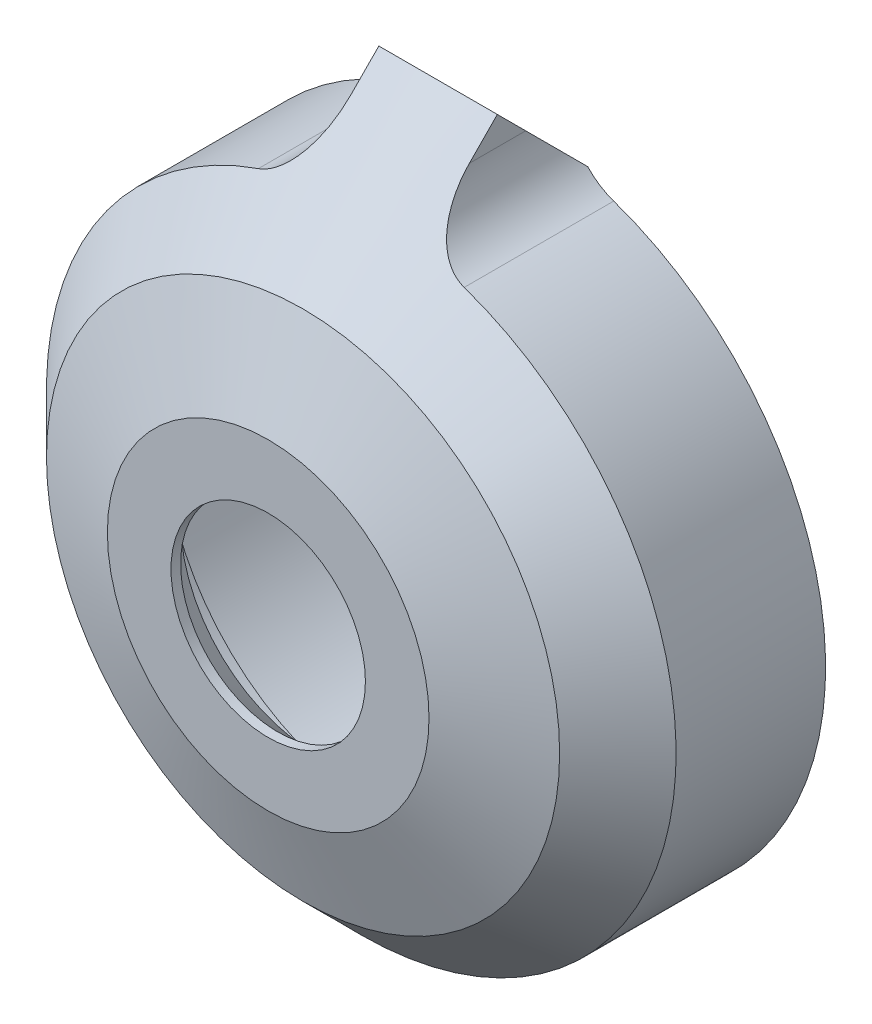
ISO-10303-21;
HEADER;
FILE_DESCRIPTION(('STEP AP214'),'2;1');
FILE_NAME('part.step','',(''),(''),'','','');
FILE_SCHEMA(('AUTOMOTIVE_DESIGN { 1 0 10303 214 1 1 1 1 }'));
ENDSEC;
DATA;
#1=APPLICATION_CONTEXT('core data for automotive mechanical design processes');
#2=APPLICATION_PROTOCOL_DEFINITION('international standard','automotive_design',2000,#1);
#3=PRODUCT_CONTEXT('',#1,'mechanical');
#4=PRODUCT('Part','Part','',(#3));
#5=PRODUCT_RELATED_PRODUCT_CATEGORY('part','',(#4));
#6=PRODUCT_DEFINITION_FORMATION('','',#4);
#7=PRODUCT_DEFINITION_CONTEXT('part definition',#1,'design');
#8=PRODUCT_DEFINITION('design','',#6,#7);
#9=PRODUCT_DEFINITION_SHAPE('','',#8);
#10=(LENGTH_UNIT() NAMED_UNIT(*) SI_UNIT(.MILLI.,.METRE.));
#11=(NAMED_UNIT(*) PLANE_ANGLE_UNIT() SI_UNIT($,.RADIAN.));
#12=(NAMED_UNIT(*) SI_UNIT($,.STERADIAN.) SOLID_ANGLE_UNIT());
#13=UNCERTAINTY_MEASURE_WITH_UNIT(LENGTH_MEASURE(1.E-05),#10,'distance_accuracy_value','');
#14=(GEOMETRIC_REPRESENTATION_CONTEXT(3) GLOBAL_UNCERTAINTY_ASSIGNED_CONTEXT((#13)) GLOBAL_UNIT_ASSIGNED_CONTEXT((#10,
#11,#12)) REPRESENTATION_CONTEXT('',''));
#15=CARTESIAN_POINT('',(0.,0.,0.));
#16=DIRECTION('',(0.,0.,1.));
#17=DIRECTION('',(1.,0.,0.));
#18=AXIS2_PLACEMENT_3D('',#15,#16,#17);
#19=CARTESIAN_POINT('',(0.,0.,0.));
#20=DIRECTION('',(0.,0.,1.));
#21=DIRECTION('',(1.,0.,0.));
#22=AXIS2_PLACEMENT_3D('',#19,#20,#21);
#23=CYLINDRICAL_SURFACE('',#22,5.25);
#24=CARTESIAN_POINT('',(0.,0.,-0.669525523584028));
#25=DIRECTION('',(0.,0.,1.));
#26=DIRECTION('',(1.,0.,0.));
#27=AXIS2_PLACEMENT_3D('',#24,#25,#26);
#28=CIRCLE('',#27,5.25);
#29=CARTESIAN_POINT('',(5.25,0.,-0.669525523584028));
#30=VERTEX_POINT('',#29);
#31=EDGE_CURVE('E338',#30,#30,#28,.T.);
#32=ORIENTED_EDGE('',*,*,#31,.F.);
#33=EDGE_LOOP('',(#32));
#34=FACE_BOUND('',#33,.T.);
#35=CARTESIAN_POINT('',(0.,0.,-0.15));
#36=DIRECTION('',(0.,0.,1.));
#37=DIRECTION('',(1.,0.,0.));
#38=AXIS2_PLACEMENT_3D('',#35,#36,#37);
#39=CIRCLE('',#38,5.25);
#40=CARTESIAN_POINT('',(5.25,0.,-0.15));
#41=VERTEX_POINT('',#40);
#42=EDGE_CURVE('E237',#41,#41,#39,.T.);
#43=ORIENTED_EDGE('',*,*,#42,.T.);
#44=EDGE_LOOP('',(#43));
#45=FACE_BOUND('',#44,.T.);
#46=ADVANCED_FACE('F38',(#34,#45),#23,.F.);
#47=CARTESIAN_POINT('',(0.,5.25,-0.15));
#48=DIRECTION('',(0.,0.,-1.));
#49=DIRECTION('',(-1.,0.,0.));
#50=AXIS2_PLACEMENT_3D('',#47,#48,#49);
#51=PLANE('',#50);
#52=ORIENTED_EDGE('',*,*,#42,.F.);
#53=EDGE_LOOP('',(#52));
#54=FACE_BOUND('',#53,.T.);
#55=CARTESIAN_POINT('',(0.,0.,-0.15));
#56=DIRECTION('',(0.,0.,1.));
#57=DIRECTION('',(1.,0.,0.));
#58=AXIS2_PLACEMENT_3D('',#55,#56,#57);
#59=CIRCLE('',#58,8.68430776677503);
#60=CARTESIAN_POINT('',(8.68430776677503,0.,-0.15));
#61=VERTEX_POINT('',#60);
#62=EDGE_CURVE('E281',#61,#61,#59,.T.);
#63=ORIENTED_EDGE('',*,*,#62,.T.);
#64=EDGE_LOOP('',(#63));
#65=FACE_BOUND('',#64,.T.);
#66=ADVANCED_FACE('F146',(#54,#65),#51,.F.);
#67=CARTESIAN_POINT('',(0.,0.,-3.17666445021254));
#68=DIRECTION('',(0.,0.,-1.));
#69=DIRECTION('',(-1.,0.,0.));
#70=AXIS2_PLACEMENT_3D('',#67,#68,#69);
#71=CONICAL_SURFACE('',#70,17.,1.22173047639603);
#72=CARTESIAN_POINT('',(0.,0.,-2.03215752970297));
#73=DIRECTION('',(0.,0.,1.));
#74=DIRECTION('',(1.,0.,0.));
#75=AXIS2_PLACEMENT_3D('',#72,#73,#74);
#76=CIRCLE('',#75,13.8554930794904);
#77=CARTESIAN_POINT('',(13.8554930794904,0.,-2.03215752970297));
#78=VERTEX_POINT('',#77);
#79=EDGE_CURVE('E229',#78,#78,#76,.T.);
#80=ORIENTED_EDGE('',*,*,#79,.T.);
#81=EDGE_LOOP('',(#80));
#82=FACE_BOUND('',#81,.T.);
#83=ORIENTED_EDGE('',*,*,#62,.F.);
#84=EDGE_LOOP('',(#83));
#85=FACE_BOUND('',#84,.T.);
#86=ADVANCED_FACE('F152',(#82,#85),#71,.T.);
#87=CARTESIAN_POINT('',(0.,0.,0.));
#88=DIRECTION('',(0.,0.,1.));
#89=DIRECTION('',(1.,0.,0.));
#90=AXIS2_PLACEMENT_3D('',#87,#88,#89);
#91=CYLINDRICAL_SURFACE('',#90,17.);
#92=CARTESIAN_POINT('',(0.,0.,-5.17666445021255));
#93=DIRECTION('',(0.,0.,-1.));
#94=DIRECTION('',(-1.,0.,0.));
#95=AXIS2_PLACEMENT_3D('',#92,#93,#94);
#96=CIRCLE('',#95,17.);
#97=CARTESIAN_POINT('',(5.55609756097561,16.0664177679071,-5.17666445021255));
#98=VERTEX_POINT('',#97);
#99=CARTESIAN_POINT('',(-5.55609756097561,16.0664177679071,-5.17666445021255));
#100=VERTEX_POINT('',#99);
#101=EDGE_CURVE('E219',#98,#100,#96,.T.);
#102=ORIENTED_EDGE('',*,*,#101,.T.);
#103=DIRECTION('',(0.,0.,1.));
#104=VECTOR('',#103,1.);
#105=CARTESIAN_POINT('',(-5.55609756097561,16.0664177679071,0.));
#106=LINE('',#105,#104);
#107=CARTESIAN_POINT('',(-5.55609756097561,16.0664177679071,-13.25));
#108=VERTEX_POINT('',#107);
#109=EDGE_CURVE('E213',#100,#108,#106,.F.);
#110=ORIENTED_EDGE('',*,*,#109,.T.);
#111=CARTESIAN_POINT('',(0.,0.,-13.25));
#112=DIRECTION('',(0.,0.,1.));
#113=DIRECTION('',(1.,0.,0.));
#114=AXIS2_PLACEMENT_3D('',#111,#112,#113);
#115=CIRCLE('',#114,17.);
#116=CARTESIAN_POINT('',(5.55609756097561,16.0664177679071,-13.25));
#117=VERTEX_POINT('',#116);
#118=EDGE_CURVE('E279',#108,#117,#115,.T.);
#119=ORIENTED_EDGE('',*,*,#118,.T.);
#120=DIRECTION('',(0.,0.,1.));
#121=VECTOR('',#120,1.);
#122=CARTESIAN_POINT('',(5.55609756097561,16.0664177679071,0.));
#123=LINE('',#122,#121);
#124=EDGE_CURVE('E227',#117,#98,#123,.T.);
#125=ORIENTED_EDGE('',*,*,#124,.T.);
#126=EDGE_LOOP('',(#102,#110,#119,#125));
#127=FACE_BOUND('',#126,.T.);
#128=ADVANCED_FACE('F223',(#127),#91,.T.);
#129=CARTESIAN_POINT('',(0.,17.,-13.25));
#130=DIRECTION('',(0.,0.,1.));
#131=DIRECTION('',(1.,0.,0.));
#132=AXIS2_PLACEMENT_3D('',#129,#130,#131);
#133=PLANE('',#132);
#134=CARTESIAN_POINT('',(0.,-15.,-13.25));
#135=DIRECTION('',(0.,0.,-1.));
#136=DIRECTION('',(-1.,0.,0.));
#137=AXIS2_PLACEMENT_3D('',#134,#135,#136);
#138=CIRCLE('',#137,0.999999999999989);
#139=CARTESIAN_POINT('',(-0.999999999999989,-15.,-13.25));
#140=VERTEX_POINT('',#139);
#141=EDGE_CURVE('E106',#140,#140,#138,.T.);
#142=ORIENTED_EDGE('',*,*,#141,.F.);
#143=EDGE_LOOP('',(#142));
#144=FACE_BOUND('',#143,.T.);
#145=ORIENTED_EDGE('',*,*,#118,.F.);
#146=CARTESIAN_POINT('',(-6.7,19.3742096612997,-13.25));
#147=DIRECTION('',(0.,0.,1.));
#148=DIRECTION('',(1.,0.,0.));
#149=AXIS2_PLACEMENT_3D('',#146,#147,#148);
#150=CIRCLE('',#149,3.5);
#151=CARTESIAN_POINT('',(-4.14869132995089,16.978207977216,-13.25));
#152=VERTEX_POINT('',#151);
#153=EDGE_CURVE('E264',#108,#152,#150,.T.);
#154=ORIENTED_EDGE('',*,*,#153,.T.);
#155=DIRECTION('',(1.,0.,0.));
#156=VECTOR('',#155,1.);
#157=CARTESIAN_POINT('',(3.2,16.978207977216,-13.25));
#158=LINE('',#157,#156);
#159=CARTESIAN_POINT('',(4.14869132995089,16.978207977216,-13.25));
#160=VERTEX_POINT('',#159);
#161=EDGE_CURVE('E60',#152,#160,#158,.T.);
#162=ORIENTED_EDGE('',*,*,#161,.T.);
#163=CARTESIAN_POINT('',(6.7,19.3742096612997,-13.25));
#164=DIRECTION('',(0.,0.,1.));
#165=DIRECTION('',(1.,0.,0.));
#166=AXIS2_PLACEMENT_3D('',#163,#164,#165);
#167=CIRCLE('',#166,3.5);
#168=EDGE_CURVE('E53',#160,#117,#167,.T.);
#169=ORIENTED_EDGE('',*,*,#168,.T.);
#170=EDGE_LOOP('',(#145,#154,#162,#169));
#171=FACE_BOUND('',#170,.T.);
#172=CARTESIAN_POINT('',(0.,0.,-13.25));
#173=DIRECTION('',(0.,0.,1.));
#174=DIRECTION('',(1.,0.,0.));
#175=AXIS2_PLACEMENT_3D('',#172,#173,#174);
#176=CIRCLE('',#175,13.05);
#177=CARTESIAN_POINT('',(13.05,0.,-13.25));
#178=VERTEX_POINT('',#177);
#179=EDGE_CURVE('E282',#178,#178,#176,.T.);
#180=ORIENTED_EDGE('',*,*,#179,.T.);
#181=EDGE_LOOP('',(#180));
#182=FACE_BOUND('',#181,.T.);
#183=ADVANCED_FACE('F277',(#144,#171,#182),#133,.F.);
#184=CARTESIAN_POINT('',(0.,0.,0.));
#185=DIRECTION('',(0.,0.,1.));
#186=DIRECTION('',(1.,0.,0.));
#187=AXIS2_PLACEMENT_3D('',#184,#185,#186);
#188=CYLINDRICAL_SURFACE('',#187,13.05);
#189=ORIENTED_EDGE('',*,*,#179,.F.);
#190=EDGE_LOOP('',(#189));
#191=FACE_BOUND('',#190,.T.);
#192=CARTESIAN_POINT('',(0.,0.,-6.45));
#193=DIRECTION('',(0.,0.,1.));
#194=DIRECTION('',(1.,0.,0.));
#195=AXIS2_PLACEMENT_3D('',#192,#193,#194);
#196=CIRCLE('',#195,13.05);
#197=CARTESIAN_POINT('',(13.05,0.,-6.45));
#198=VERTEX_POINT('',#197);
#199=EDGE_CURVE('E290',#198,#198,#196,.T.);
#200=ORIENTED_EDGE('',*,*,#199,.T.);
#201=EDGE_LOOP('',(#200));
#202=FACE_BOUND('',#201,.T.);
#203=ADVANCED_FACE('F309',(#191,#202),#188,.F.);
#204=CARTESIAN_POINT('',(0.,13.05,-6.45));
#205=DIRECTION('',(0.,0.,1.));
#206=DIRECTION('',(1.,0.,0.));
#207=AXIS2_PLACEMENT_3D('',#204,#205,#206);
#208=PLANE('',#207);
#209=ORIENTED_EDGE('',*,*,#199,.F.);
#210=EDGE_LOOP('',(#209));
#211=FACE_BOUND('',#210,.T.);
#212=CARTESIAN_POINT('',(0.,0.,-6.45));
#213=DIRECTION('',(0.,0.,1.));
#214=DIRECTION('',(1.,0.,0.));
#215=AXIS2_PLACEMENT_3D('',#212,#213,#214);
#216=CIRCLE('',#215,11.95);
#217=CARTESIAN_POINT('',(11.95,0.,-6.45));
#218=VERTEX_POINT('',#217);
#219=EDGE_CURVE('E357',#218,#218,#216,.T.);
#220=ORIENTED_EDGE('',*,*,#219,.T.);
#221=EDGE_LOOP('',(#220));
#222=FACE_BOUND('',#221,.T.);
#223=ADVANCED_FACE('F313',(#211,#222),#208,.F.);
#224=CARTESIAN_POINT('',(0.,0.,0.));
#225=DIRECTION('',(0.,0.,1.));
#226=DIRECTION('',(1.,0.,0.));
#227=AXIS2_PLACEMENT_3D('',#224,#225,#226);
#228=CYLINDRICAL_SURFACE('',#227,11.95);
#229=CARTESIAN_POINT('',(0.,11.95,-3.05991252012217));
#230=CARTESIAN_POINT('',(0.0365782255104416,11.9500001420507,-3.05991065504105));
#231=CARTESIAN_POINT('',(0.0731487146338649,11.9498301767511,-3.06331370412901));
#232=CARTESIAN_POINT('',(0.14506534239268,11.9491736231201,-3.07665801995361));
#233=CARTESIAN_POINT('',(0.180411288112023,11.9486869851365,-3.08660031200415));
#234=CARTESIAN_POINT('',(0.24869150346104,11.9474606289327,-3.11226505086547));
#235=CARTESIAN_POINT('',(0.281637438193024,11.9467222500168,-3.12795694118684));
#236=CARTESIAN_POINT('',(0.344690060686423,11.9450695175844,-3.16423256930768));
#237=CARTESIAN_POINT('',(0.374795328847132,11.9441550767691,-3.18481873508549));
#238=CARTESIAN_POINT('',(0.44190017515811,11.9418892060334,-3.23795381648505));
#239=CARTESIAN_POINT('',(0.477585187371523,11.940497421068,-3.27216092095701));
#240=CARTESIAN_POINT('',(0.542943940415101,11.9377043602575,-3.34589688204519));
#241=CARTESIAN_POINT('',(0.572606405785233,11.9363030715946,-3.38543549429113));
#242=CARTESIAN_POINT('',(0.635376005293842,11.9331516849561,-3.48268891901409));
#243=CARTESIAN_POINT('',(0.666094827113483,11.9314497141365,-3.54194357988497));
#244=CARTESIAN_POINT('',(0.717667164610882,11.9284581386696,-3.66457083217996));
#245=CARTESIAN_POINT('',(0.738506850126401,11.9271691129323,-3.72794905609519));
#246=CARTESIAN_POINT('',(0.775727767153042,11.9248144825424,-3.87545037982207));
#247=CARTESIAN_POINT('',(0.78913437752916,11.9239179143421,-3.96032725304849));
#248=CARTESIAN_POINT('',(0.801986368956129,11.9230595627347,-4.13116327080953));
#249=CARTESIAN_POINT('',(0.801413808684929,11.9230989806008,-4.21712366461546));
#250=CARTESIAN_POINT('',(0.786628333478721,11.9240837079226,-4.38875102711458));
#251=CARTESIAN_POINT('',(0.772275191949475,11.9250383300455,-4.47440588552277));
#252=CARTESIAN_POINT('',(0.729366869282106,11.9277407757348,-4.64205599248114));
#253=CARTESIAN_POINT('',(0.700836830957014,11.9294871945662,-4.72405744082798));
#254=CARTESIAN_POINT('',(0.641040672938705,11.9328165454733,-4.8535998033338));
#255=CARTESIAN_POINT('',(0.614190631940613,11.9342444618466,-4.90319344362583));
#256=CARTESIAN_POINT('',(0.55342935732567,11.9372168164007,-4.99787275903721));
#257=CARTESIAN_POINT('',(0.519529181715645,11.9387610697185,-5.04296533200154));
#258=CARTESIAN_POINT('',(0.453855968617292,11.9414109892863,-5.11569546916768));
#259=CARTESIAN_POINT('',(0.42376437193107,11.9425276300306,-5.14484473357868));
#260=CARTESIAN_POINT('',(0.359358433293014,11.9446387712425,-5.19806791559609));
#261=CARTESIAN_POINT('',(0.325050207871967,11.945633444542,-5.2221490504224));
#262=CARTESIAN_POINT('',(0.259898821604213,11.9472083527787,-5.25939174466747));
#263=CARTESIAN_POINT('',(0.229760245188296,11.9478317230012,-5.27377697479575));
#264=CARTESIAN_POINT('',(0.167507332976603,11.9488663433965,-5.29737216959951));
#265=CARTESIAN_POINT('',(0.135394570788882,11.9492777601235,-5.30658619834629));
#266=CARTESIAN_POINT('',(0.069831916781541,11.9498410960215,-5.31915024845375));
#267=CARTESIAN_POINT('',(0.0363755375498333,11.9499915473361,-5.32246710247229));
#268=CARTESIAN_POINT('',(-0.0305697977082109,11.9500077475083,-5.3228257358653));
#269=CARTESIAN_POINT('',(-0.0640587489035733,11.9498735335856,-5.31986833558873));
#270=CARTESIAN_POINT('',(-0.127057256907305,11.9493624847206,-5.30847958655144));
#271=CARTESIAN_POINT('',(-0.156659673675192,11.9490077548605,-5.30054643231601));
#272=CARTESIAN_POINT('',(-0.214281149097674,11.9481134714966,-5.28023349357163));
#273=CARTESIAN_POINT('',(-0.242299578823798,11.9475738451711,-5.26785195696763));
#274=CARTESIAN_POINT('',(-0.306271808984122,11.9461317811669,-5.23406399135343));
#275=CARTESIAN_POINT('',(-0.341355126672165,11.9451688973701,-5.21101313474656));
#276=CARTESIAN_POINT('',(-0.407336074460432,11.9431014775941,-5.15955471741721));
#277=CARTESIAN_POINT('',(-0.438224968578753,11.9419966550238,-5.1311362627395));
#278=CARTESIAN_POINT('',(-0.507572829681704,11.9392849107746,-5.05791175525987));
#279=CARTESIAN_POINT('',(-0.543964843566441,11.9376573553462,-5.01115548821468));
#280=CARTESIAN_POINT('',(-0.608945439775015,11.9345188733808,-4.91253483522141));
#281=CARTESIAN_POINT('',(-0.637519734704973,11.9330081639529,-4.86066132939838));
#282=CARTESIAN_POINT('',(-0.697045884694066,11.9297040580096,-4.73299881419098));
#283=CARTESIAN_POINT('',(-0.724703368123764,11.9280245994358,-4.65567035276351));
#284=CARTESIAN_POINT('',(-0.767273598514149,11.9253610046891,-4.49760045698213));
#285=CARTESIAN_POINT('',(-0.78217300980031,11.9243775962648,-4.41685554376127));
#286=CARTESIAN_POINT('',(-0.799745746514571,11.923212074208,-4.25251809400401));
#287=CARTESIAN_POINT('',(-0.802185865531579,11.9230452472706,-4.16890053428746));
#288=CARTESIAN_POINT('',(-0.793909439972684,11.9235997955933,-4.00232530161409));
#289=CARTESIAN_POINT('',(-0.783202761489035,11.9243205047979,-3.91936718077841));
#290=CARTESIAN_POINT('',(-0.751139768049477,11.9263777781744,-3.77213466275664));
#291=CARTESIAN_POINT('',(-0.732219347546183,11.9275697432288,-3.70732801584499));
#292=CARTESIAN_POINT('',(-0.68443734515339,11.9304076188118,-3.58147103236047));
#293=CARTESIAN_POINT('',(-0.655589804591357,11.9320528875172,-3.5204155329969));
#294=CARTESIAN_POINT('',(-0.596052130022021,11.9351521664466,-3.41968135708322));
#295=CARTESIAN_POINT('',(-0.567787477287878,11.9365448290887,-3.37856979014132));
#296=CARTESIAN_POINT('',(-0.505126796469656,11.9393604932975,-3.3012987005634));
#297=CARTESIAN_POINT('',(-0.47073954011248,11.9407834489295,-3.26513222255361));
#298=CARTESIAN_POINT('',(-0.403605703948594,11.9432191696475,-3.20638893483038));
#299=CARTESIAN_POINT('',(-0.371971859720708,11.9442561690706,-3.18254653533315));
#300=CARTESIAN_POINT('',(-0.305205889498192,11.9461483963363,-3.14033682149747));
#301=CARTESIAN_POINT('',(-0.270075446472842,11.9470037110113,-3.1219668900108));
#302=CARTESIAN_POINT('',(-0.19660383326369,11.948439589715,-3.09169077526232));
#303=CARTESIAN_POINT('',(-0.158229980200457,11.9490168311573,-3.07986252015871));
#304=CARTESIAN_POINT('',(-0.079900223214577,11.9497968217659,-3.06397725333972));
#305=CARTESIAN_POINT('',(-0.0399454984462531,11.9499998448726,-3.0599145568966));
#306=CARTESIAN_POINT('',(0.,11.95,-3.05991252012217));
#307=B_SPLINE_CURVE_WITH_KNOTS('',3,(#229,#230,#231,#232,#233,#234,#235,#236,#237,#238,#239,
#240,#241,#242,#243,#244,#245,#246,#247,#248,#249,#250,#251,#252,#253,#254,#255,#256,#257,#258,
#259,#260,#261,#262,#263,#264,#265,#266,#267,#268,#269,#270,#271,#272,#273,#274,#275,#276,#277,
#278,#279,#280,#281,#282,#283,#284,#285,#286,#287,#288,#289,#290,#291,#292,#293,#294,#295,#296,
#297,#298,#299,#300,#301,#302,#303,#304,#305,#306),.UNSPECIFIED.,.T.,.F.,(4,2,2,2,2,2,2,2,2,2,2,
2,2,2,2,2,2,2,2,2,2,2,2,2,2,2,2,2,2,2,2,2,2,2,2,2,2,2,4),(0.,0.109569330497726,
0.219155844903069,0.328168210020482,0.437234767834737,0.58477803685809,0.732595040879044,
0.931807770269931,1.13129856718958,1.38778159470543,1.64459381816024,1.90404728208137,
2.16304223722277,2.33180588253313,2.50030679500155,2.62562385974943,2.7507612420733,
2.85056540461644,2.95029102036995,3.05057576720117,3.15084740276631,3.2424024982694,
3.33399369440286,3.45926394694883,3.58479123164458,3.76163070552247,3.93879123847006,
4.18392619421529,4.42931707132853,4.67928463342747,4.9290647204796,5.13094671942263,
5.33254433391883,5.48177071208276,5.63078499225201,5.74920414148407,5.86756656679553,
5.98731018605578,6.10696611414077),.UNSPECIFIED.);
#308=CARTESIAN_POINT('',(0.,11.95,-3.05991252012217));
#309=VERTEX_POINT('',#308);
#310=EDGE_CURVE('E112',#309,#309,#307,.T.);
#311=ORIENTED_EDGE('',*,*,#310,.T.);
#312=EDGE_LOOP('',(#311));
#313=FACE_BOUND('',#312,.T.);
#314=ORIENTED_EDGE('',*,*,#219,.F.);
#315=EDGE_LOOP('',(#314));
#316=FACE_BOUND('',#315,.T.);
#317=CARTESIAN_POINT('',(0.,0.,-2.65));
#318=DIRECTION('',(0.,0.,1.));
#319=DIRECTION('',(1.,0.,0.));
#320=AXIS2_PLACEMENT_3D('',#317,#318,#319);
#321=CIRCLE('',#320,11.95);
#322=CARTESIAN_POINT('',(11.95,0.,-2.65));
#323=VERTEX_POINT('',#322);
#324=EDGE_CURVE('E351',#323,#323,#321,.T.);
#325=ORIENTED_EDGE('',*,*,#324,.T.);
#326=EDGE_LOOP('',(#325));
#327=FACE_BOUND('',#326,.T.);
#328=ADVANCED_FACE('F317',(#313,#316,#327),#228,.F.);
#329=CARTESIAN_POINT('',(0.,11.95,-2.65));
#330=DIRECTION('',(0.,0.,1.));
#331=DIRECTION('',(1.,0.,0.));
#332=AXIS2_PLACEMENT_3D('',#329,#330,#331);
#333=PLANE('',#332);
#334=ORIENTED_EDGE('',*,*,#324,.F.);
#335=EDGE_LOOP('',(#334));
#336=FACE_BOUND('',#335,.T.);
#337=CARTESIAN_POINT('',(0.,0.,-2.65));
#338=DIRECTION('',(0.,0.,1.));
#339=DIRECTION('',(1.,0.,0.));
#340=AXIS2_PLACEMENT_3D('',#337,#338,#339);
#341=CIRCLE('',#340,7.23047447641597);
#342=CARTESIAN_POINT('',(7.23047447641597,0.,-2.65));
#343=VERTEX_POINT('',#342);
#344=EDGE_CURVE('E343',#343,#343,#341,.T.);
#345=ORIENTED_EDGE('',*,*,#344,.T.);
#346=EDGE_LOOP('',(#345));
#347=FACE_BOUND('',#346,.T.);
#348=ADVANCED_FACE('F321',(#336,#347),#333,.F.);
#349=CARTESIAN_POINT('',(0.,0.,-0.669525523584028));
#350=DIRECTION('',(0.,0.,-1.));
#351=DIRECTION('',(-1.,0.,0.));
#352=AXIS2_PLACEMENT_3D('',#349,#350,#351);
#353=CONICAL_SURFACE('',#352,5.25,0.785398163397447);
#354=ORIENTED_EDGE('',*,*,#344,.F.);
#355=EDGE_LOOP('',(#354));
#356=FACE_BOUND('',#355,.T.);
#357=ORIENTED_EDGE('',*,*,#31,.T.);
#358=EDGE_LOOP('',(#357));
#359=FACE_BOUND('',#358,.T.);
#360=ADVANCED_FACE('F167',(#356,#359),#353,.F.);
#361=CARTESIAN_POINT('',(0.,0.,-2.03215752970297));
#362=DIRECTION('',(0.,0.,-1.));
#363=DIRECTION('',(-1.,0.,0.));
#364=AXIS2_PLACEMENT_3D('',#361,#362,#363);
#365=CONICAL_SURFACE('',#364,13.8554930794904,0.785398163397447);
#366=CARTESIAN_POINT('',(3.2,35.3873165739287,-23.7083710557705));
#367=CARTESIAN_POINT('',(3.2,34.7138626664,-23.0376549279627));
#368=CARTESIAN_POINT('',(3.2,34.040332521458,-22.3670153641636));
#369=CARTESIAN_POINT('',(3.2,32.69308643694,-21.0259227674995));
#370=CARTESIAN_POINT('',(3.2,32.0193704973476,-20.3554697346511));
#371=CARTESIAN_POINT('',(3.2,29.9980681601652,-18.3446137903223));
#372=CARTESIAN_POINT('',(3.2,28.6501533828605,-17.0045408441741));
#373=CARTESIAN_POINT('',(3.2,26.6275243973093,-14.9956686159349));
#374=CARTESIAN_POINT('',(3.2,25.9533075138132,-14.3263686109532));
#375=CARTESIAN_POINT('',(3.2,24.6044558438463,-12.9881949264903));
#376=CARTESIAN_POINT('',(3.2,23.929821058976,-12.3193212453959));
#377=CARTESIAN_POINT('',(3.2,22.5799335205968,-10.982034994318));
#378=CARTESIAN_POINT('',(3.2,21.9046807024371,-10.3136224895849));
#379=CARTESIAN_POINT('',(3.2,20.5534632705275,-8.97749850157707));
#380=CARTESIAN_POINT('',(3.2,19.8774986470596,-8.30978702812834));
#381=CARTESIAN_POINT('',(3.2,18.5241321183952,-6.97483064349639));
#382=CARTESIAN_POINT('',(3.2,17.846729523372,-6.30758643140159));
#383=CARTESIAN_POINT('',(3.2,16.4906484438861,-4.97446311029471));
#384=CARTESIAN_POINT('',(3.2,15.8119700246865,-4.30858393491289));
#385=CARTESIAN_POINT('',(3.2,14.4529954705615,-2.97900003289255));
#386=CARTESIAN_POINT('',(3.2,13.7727000587737,-2.31529456800868));
#387=CARTESIAN_POINT('',(3.2,12.75004344251,-1.32189733599106));
#388=CARTESIAN_POINT('',(3.2,12.4087595435376,-0.991096732077614));
#389=CARTESIAN_POINT('',(3.2,11.7252695137188,-0.330439123099095));
#390=CARTESIAN_POINT('',(3.2,11.3830633694327,-0.000582131931157841));
#391=CARTESIAN_POINT('',(3.2,10.6970133186182,0.658347504590271));
#392=CARTESIAN_POINT('',(3.2,10.3531678312126,0.987418504911834));
#393=CARTESIAN_POINT('',(3.2,9.66393844436271,1.64391192070728));
#394=CARTESIAN_POINT('',(3.2,9.31855462445911,1.97133441959525));
#395=CARTESIAN_POINT('',(3.2,8.6258830610386,2.62375291758115));
#396=CARTESIAN_POINT('',(3.2,8.27859655274275,2.94875022698488));
#397=CARTESIAN_POINT('',(3.2,7.58102465073527,3.59565246549973));
#398=CARTESIAN_POINT('',(3.2,7.23073871016014,3.91755680696888));
#399=CARTESIAN_POINT('',(3.2,6.70171559596433,4.39719850935003));
#400=CARTESIAN_POINT('',(3.2,6.5245871408403,4.5567095109751));
#401=CARTESIAN_POINT('',(3.2,6.1689952986531,4.87422962894828));
#402=CARTESIAN_POINT('',(3.2,5.99053194540391,5.03223878311063));
#403=CARTESIAN_POINT('',(3.2,5.63203531428258,5.34627231946561));
#404=CARTESIAN_POINT('',(3.2,5.45200293694792,5.50229772811939));
#405=CARTESIAN_POINT('',(3.2,5.0898108524175,5.81190249318411));
#406=CARTESIAN_POINT('',(3.2,4.90765093879978,5.96548160877096));
#407=CARTESIAN_POINT('',(3.2,4.54017861501305,6.26972669315932));
#408=CARTESIAN_POINT('',(3.2,4.35485974894157,6.42038488297553));
#409=CARTESIAN_POINT('',(3.2,3.9806888991025,6.71717724897809));
#410=CARTESIAN_POINT('',(3.2,3.79183789593226,6.8633126517349));
#411=CARTESIAN_POINT('',(3.2,3.5047914899307,7.07785924264583));
#412=CARTESIAN_POINT('',(3.2,3.40838622615857,7.14866472750309));
#413=CARTESIAN_POINT('',(3.2,3.21417715039603,7.28831877286238));
#414=CARTESIAN_POINT('',(3.2,3.11637345171785,7.35716749058155));
#415=CARTESIAN_POINT('',(3.2,2.91904188779153,7.49255878268267));
#416=CARTESIAN_POINT('',(3.2,2.81951252012123,7.55909917876184));
#417=CARTESIAN_POINT('',(3.2,2.61850995998822,7.68923348282644));
#418=CARTESIAN_POINT('',(3.2,2.51703623026945,7.75282655933276));
#419=CARTESIAN_POINT('',(3.2,2.41446445261089,7.81464017686108));
#420=B_SPLINE_CURVE_WITH_KNOTS('',3,(#366,#367,#368,#369,#370,#371,#372,#373,#374,#375,#376,
#377,#378,#379,#380,#381,#382,#383,#384,#385,#386,#387,#388,#389,#390,#391,#392,#393,#394,#395,
#396,#397,#398,#399,#400,#401,#402,#403,#404,#405,#406,#407,#408,#409,#410,#411,#412,#413,#414,
#415,#416,#417,#418,#419),.UNSPECIFIED.,.F.,.F.,(4,2,2,2,2,2,2,2,2,2,2,2,2,2,2,2,2,2,2,2,2,2,2,
2,2,2,4),(0.,2.85142112084905,5.70284249417011,11.4049490348792,14.2549976915041,17.10503549998,
19.9554166211782,22.8058371751141,25.6583438203894,28.5107083177194,31.361975027983,
32.7878536400006,34.213753144753,35.6415648222887,37.0693035115317,38.4962049779893,
39.9233723879132,40.6384634007979,41.3535363608248,42.0682228819665,42.7829793305621,
43.4994321442991,44.2156889239392,44.5745101771506,44.9333025187701,45.2924247100326,
45.6516476054367),.UNSPECIFIED.);
#421=CARTESIAN_POINT('',(3.2,20.9040164230179,-9.32419155419809));
#422=VERTEX_POINT('',#421);
#423=CARTESIAN_POINT('',(3.2,19.3742096612854,-7.81336478401211));
#424=VERTEX_POINT('',#423);
#425=EDGE_CURVE('E174',#422,#424,#420,.T.);
#426=ORIENTED_EDGE('',*,*,#425,.F.);
#427=CARTESIAN_POINT('',(3.2,20.9040164230179,-9.32419155419809));
#428=CARTESIAN_POINT('',(2.13618978689757,20.9849705270475,-9.24323745016855));
#429=CARTESIAN_POINT('',(1.07237139448852,21.0255553511591,-9.20265262605689));
#430=CARTESIAN_POINT('',(-1.06096185126789,21.0259875904045,-9.20222038681156));
#431=CARTESIAN_POINT('',(-2.13047679219218,20.9854027662928,-9.24280521092322));
#432=CARTESIAN_POINT('',(-3.2,20.9040164230179,-9.32419155419809));
#433=B_SPLINE_CURVE_WITH_KNOTS('',3,(#427,#428,#429,#430,#431,#432),.UNSPECIFIED.,.F.,.F.,(4,2,
4),(0.,3.19609675249625,6.40925846377218),.UNSPECIFIED.);
#434=CARTESIAN_POINT('',(-3.2,20.9040164230179,-9.32419155419809));
#435=VERTEX_POINT('',#434);
#436=EDGE_CURVE('E181',#422,#435,#433,.T.);
#437=ORIENTED_EDGE('',*,*,#436,.T.);
#438=CARTESIAN_POINT('',(-3.2,2.41446440404427,7.81464020611309));
#439=CARTESIAN_POINT('',(-3.2,2.49925352877417,7.76355472284158));
#440=CARTESIAN_POINT('',(-3.2,2.58328977524108,7.71124122265293));
#441=CARTESIAN_POINT('',(-3.2,2.75000345591082,7.60452256149115));
#442=CARTESIAN_POINT('',(-3.2,2.83268113926288,7.5501177902914));
#443=CARTESIAN_POINT('',(-3.2,2.99679916292009,7.439600001202));
#444=CARTESIAN_POINT('',(-3.2,3.07824031993541,7.38348819156708));
#445=CARTESIAN_POINT('',(-3.2,3.24008590450001,7.26978275689169));
#446=CARTESIAN_POINT('',(-3.2,3.32049027675082,7.21218905329892));
#447=CARTESIAN_POINT('',(-3.2,3.56004127743259,7.03774338621595));
#448=CARTESIAN_POINT('',(-3.2,3.71782685057383,6.91902172835273));
#449=CARTESIAN_POINT('',(-3.2,4.03058072940894,6.67788221033619));
#450=CARTESIAN_POINT('',(-3.2,4.18554844424535,6.55546358898945));
#451=CARTESIAN_POINT('',(-3.2,4.49292103134714,6.30808030241984));
#452=CARTESIAN_POINT('',(-3.2,4.64533042221822,6.18312123896046));
#453=CARTESIAN_POINT('',(-3.2,4.94833765595095,5.93105372176599));
#454=CARTESIAN_POINT('',(-3.2,5.09893563205663,5.80394542779922));
#455=CARTESIAN_POINT('',(-3.2,5.39876027580285,5.54794550403887));
#456=CARTESIAN_POINT('',(-3.2,5.54798607783788,5.41905286199141));
#457=CARTESIAN_POINT('',(-3.2,5.84523833528575,5.15988842220499));
#458=CARTESIAN_POINT('',(-3.2,5.99326476844366,5.02961659897757));
#459=CARTESIAN_POINT('',(-3.2,6.42263769335708,4.64885127389764));
#460=CARTESIAN_POINT('',(-3.2,6.70267248745916,4.39687902434366));
#461=CARTESIAN_POINT('',(-3.2,7.26015562585123,3.89008605846387));
#462=CARTESIAN_POINT('',(-3.2,7.53760390963598,3.63526527580854));
#463=CARTESIAN_POINT('',(-3.2,8.09058900807103,3.12352810414369));
#464=CARTESIAN_POINT('',(-3.2,8.36612571118562,2.86661159472563));
#465=CARTESIAN_POINT('',(-3.2,8.91572891879084,2.3512098540504));
#466=CARTESIAN_POINT('',(-3.2,9.18979541553218,2.09272461453994));
#467=CARTESIAN_POINT('',(-3.2,10.0102496430277,1.315522697569));
#468=CARTESIAN_POINT('',(-3.2,10.554940137882,0.795015116056142));
#469=CARTESIAN_POINT('',(-3.2,11.6414254902316,-0.248964074638452));
#470=CARTESIAN_POINT('',(-3.2,12.1832204586797,-0.77243556864093));
#471=CARTESIAN_POINT('',(-3.2,13.266476554707,-1.82297933865345));
#472=CARTESIAN_POINT('',(-3.2,13.807931767766,-2.35005771043107));
#473=CARTESIAN_POINT('',(-3.2,14.8894515168085,-3.40564877041973));
#474=CARTESIAN_POINT('',(-3.2,15.4295160392006,-3.93416147254588));
#475=CARTESIAN_POINT('',(-3.2,16.5085977265901,-4.99221013063186));
#476=CARTESIAN_POINT('',(-3.2,17.0476149339404,-5.52174604341045));
#477=CARTESIAN_POINT('',(-3.2,18.124875250066,-6.58160475552547));
#478=CARTESIAN_POINT('',(-3.2,18.66311835862,-7.11192755508661));
#479=CARTESIAN_POINT('',(-3.2,19.8790110214253,-8.31127715078025));
#480=CARTESIAN_POINT('',(-3.2,20.5564849482989,-8.98048197241872));
#481=CARTESIAN_POINT('',(-3.2,21.9107273528982,-10.3196060680748));
#482=CARTESIAN_POINT('',(-3.2,22.5874958299848,-10.9895253427385));
#483=CARTESIAN_POINT('',(-3.2,24.6170198885868,-13.000107854359));
#484=CARTESIAN_POINT('',(-3.2,25.9689760573689,-14.3415779639936));
#485=CARTESIAN_POINT('',(-3.2,28.6658240990214,-17.0201265254643));
#486=CARTESIAN_POINT('',(-3.2,30.0107215470757,-18.3571993666573));
#487=CARTESIAN_POINT('',(-3.2,32.0273996824103,-20.3634586188982));
#488=CARTESIAN_POINT('',(-3.2,32.6995090331414,-21.0323147004776));
#489=CARTESIAN_POINT('',(-3.2,34.0435428661476,-22.3702123818137));
#490=CARTESIAN_POINT('',(-3.2,34.7154673484504,-23.0392539815427));
#491=CARTESIAN_POINT('',(-3.2,35.3873166128134,-23.7083710944973));
#492=B_SPLINE_CURVE_WITH_KNOTS('',3,(#438,#439,#440,#441,#442,#443,#444,#445,#446,#447,#448,
#449,#450,#451,#452,#453,#454,#455,#456,#457,#458,#459,#460,#461,#462,#463,#464,#465,#466,#467,
#468,#469,#470,#471,#472,#473,#474,#475,#476,#477,#478,#479,#480,#481,#482,#483,#484,#485,#486,
#487,#488,#489,#490,#491),.UNSPECIFIED.,.F.,.F.,(4,2,2,2,2,2,2,2,2,2,2,2,2,2,2,2,2,2,2,2,2,2,2,
2,2,2,4),(0.,0.29694189337889,0.593828708229562,0.890510061501753,1.18720717380373,
1.77950902510515,2.37193367236269,2.96316956808809,3.55436170440086,4.14590421241625,
4.73745767179588,5.86755185773824,6.9976724135382,8.12785836350293,9.25805026469133,
11.5182372338079,13.7783369655365,16.0452401900399,18.3121654860025,20.5789971167995,
22.8458293950849,25.7026195177978,28.559412226087,34.273073704059,39.9624155853054,
42.8070411755636,45.6516663396894),.UNSPECIFIED.);
#493=CARTESIAN_POINT('',(-3.2,19.3742096612997,-7.81336478402628));
#494=VERTEX_POINT('',#493);
#495=EDGE_CURVE('E125',#494,#435,#492,.T.);
#496=ORIENTED_EDGE('',*,*,#495,.F.);
#497=CARTESIAN_POINT('',(-3.2,19.3742096612997,-7.81336478402628));
#498=CARTESIAN_POINT('',(-3.20001958128294,19.2696906098699,-7.71025569220449));
#499=CARTESIAN_POINT('',(-3.20468330764567,19.1647744310192,-7.60751504670651));
#500=CARTESIAN_POINT('',(-3.22365421808854,18.9544211965913,-7.40324002651108));
#501=CARTESIAN_POINT('',(-3.23797199013556,18.848983695426,-7.30170710091758));
#502=CARTESIAN_POINT('',(-3.27680258049599,18.6370284863048,-7.09953103509377));
#503=CARTESIAN_POINT('',(-3.30141681909983,18.5305106145052,-6.99890721262055));
#504=CARTESIAN_POINT('',(-3.36134911133561,18.317993683576,-6.80044575997938));
#505=CARTESIAN_POINT('',(-3.39666222502051,18.211994407901,-6.70260686669686));
#506=CARTESIAN_POINT('',(-3.50029318512174,17.9452841328194,-6.45990155779959));
#507=CARTESIAN_POINT('',(-3.57619478694356,17.7852096285303,-6.31745434425152));
#508=CARTESIAN_POINT('',(-3.75736343645582,17.4706054125535,-6.04633929147437));
#509=CARTESIAN_POINT('',(-3.86253690750474,17.3160597741298,-5.91762932152574));
#510=CARTESIAN_POINT('',(-4.07445170184682,17.0553771883927,-5.71161037826874));
#511=CARTESIAN_POINT('',(-4.17382788629254,16.9470155002851,-5.62959665921971));
#512=CARTESIAN_POINT('',(-4.39186075315274,16.7388517131946,-5.48158993724274));
#513=CARTESIAN_POINT('',(-4.51049650151093,16.6390404982957,-5.41557973149818));
#514=CARTESIAN_POINT('',(-4.74097740259951,16.47105250566,-5.31604386654161));
#515=CARTESIAN_POINT('',(-4.84944309129897,16.400539692195,-5.27866288270761));
#516=CARTESIAN_POINT('',(-5.07684505055573,16.2706001048372,-5.22045011017703));
#517=CARTESIAN_POINT('',(-5.19575528156855,16.2111468516626,-5.19957839382157));
#518=CARTESIAN_POINT('',(-5.3572536681436,16.141741110622,-5.18413804748576));
#519=CARTESIAN_POINT('',(-5.39659978934423,16.1256769703979,-5.18133828828924));
#520=CARTESIAN_POINT('',(-5.47590654685673,16.0949727646338,-5.17760284552508));
#521=CARTESIAN_POINT('',(-5.51586684129212,16.080331937851,-5.17666616023838));
#522=CARTESIAN_POINT('',(-5.55609756097561,16.0664177679071,-5.17666445021255));
#523=B_SPLINE_CURVE_WITH_KNOTS('',3,(#497,#498,#499,#500,#501,#502,#503,#504,#505,#506,#507,
#508,#509,#510,#511,#512,#513,#514,#515,#516,#517,#518,#519,#520,#521,#522),.UNSPECIFIED.,.F.,
.F.,(4,2,2,2,2,2,2,2,2,2,2,2,4),(0.,0.440416285376759,0.881316379760647,1.32666559845068,
1.77180950046941,2.45178215076218,3.12960554274115,3.6330383568936,4.13592758740259,
4.53833606783809,4.9397683221077,5.06749070239654,5.19514439160242),.UNSPECIFIED.);
#524=EDGE_CURVE('E189',#494,#100,#523,.T.);
#525=ORIENTED_EDGE('',*,*,#524,.T.);
#526=ORIENTED_EDGE('',*,*,#101,.F.);
#527=CARTESIAN_POINT('',(5.55609756097561,16.0664177679071,-5.17666445021255));
#528=CARTESIAN_POINT('',(5.48513314872282,16.0909354008204,-5.17663488771009));
#529=CARTESIAN_POINT('',(5.41499285645183,16.1177700420348,-5.1795766482684));
#530=CARTESIAN_POINT('',(5.27705373254878,16.1756521132171,-5.1911738855945));
#531=CARTESIAN_POINT('',(5.20925222010648,16.2066945041626,-5.19982257518944));
#532=CARTESIAN_POINT('',(5.07725553629055,16.2722618032358,-5.22247819698532));
#533=CARTESIAN_POINT('',(5.01302848820493,16.3067438317947,-5.2364240566707));
#534=CARTESIAN_POINT('',(4.8878006945267,16.3790190107324,-5.26929145287437));
#535=CARTESIAN_POINT('',(4.82680071166415,16.4168129383345,-5.28821415943558));
#536=CARTESIAN_POINT('',(4.64966618537857,16.5341247653505,-5.35160260787153));
#537=CARTESIAN_POINT('',(4.53869867948606,16.6179256374024,-5.40281631600915));
#538=CARTESIAN_POINT('',(4.33157628239461,16.7936789421194,-5.51953192236854));
#539=CARTESIAN_POINT('',(4.23546190426481,16.8856526281981,-5.58507176170019));
#540=CARTESIAN_POINT('',(4.01094828016609,17.1251291649901,-5.76444534334697));
#541=CARTESIAN_POINT('',(3.89227722239695,17.2763229710978,-5.88551301567282));
#542=CARTESIAN_POINT('',(3.68542602481967,17.5861135644664,-6.14429366863626));
#543=CARTESIAN_POINT('',(3.59740684722155,17.7447446119166,-6.28208954338259));
#544=CARTESIAN_POINT('',(3.46691659792218,18.0269285449254,-6.53377610830289));
#545=CARTESIAN_POINT('',(3.41858601435464,18.1497890366876,-6.64549374826979));
#546=CARTESIAN_POINT('',(3.33679077854958,18.3965897612127,-6.87331535548344));
#547=CARTESIAN_POINT('',(3.30334018236518,18.5205309026061,-6.9894233581571));
#548=CARTESIAN_POINT('',(3.25089612437862,18.7665454525894,-7.2226439942857));
#549=CARTESIAN_POINT('',(3.23167537108913,18.8886162893252,-7.33970921423511));
#550=CARTESIAN_POINT('',(3.20625881087752,19.1320394001185,-7.57548238496036));
#551=CARTESIAN_POINT('',(3.20003570050705,19.2533926453942,-7.69418636383574));
#552=CARTESIAN_POINT('',(3.2,19.374209661293,-7.81336478401965));
#553=B_SPLINE_CURVE_WITH_KNOTS('',3,(#527,#528,#529,#530,#531,#532,#533,#534,#535,#536,#537,
#538,#539,#540,#541,#542,#543,#544,#545,#546,#547,#548,#549,#550,#551,#552),.UNSPECIFIED.,.F.,
.F.,(4,2,2,2,2,2,2,2,2,2,2,2,4),(0.,0.225109138232318,0.449951038593317,0.67227570969569,
0.89465269550625,1.33706145735346,1.7806563986731,2.45833768979768,3.13952584539001,
3.65766112366827,4.17628481305327,4.68643446015318,5.19551138109537),.UNSPECIFIED.);
#554=EDGE_CURVE('E11',#98,#424,#553,.T.);
#555=ORIENTED_EDGE('',*,*,#554,.T.);
#556=EDGE_LOOP('',(#426,#437,#496,#525,#526,#555));
#557=FACE_BOUND('',#556,.T.);
#558=ORIENTED_EDGE('',*,*,#79,.F.);
#559=EDGE_LOOP('',(#558));
#560=FACE_BOUND('',#559,.T.);
#561=ADVANCED_FACE('F159',(#557,#560),#365,.T.);
#562=CARTESIAN_POINT('',(-3.2,16.6961073307523,-0.149));
#563=DIRECTION('',(-1.,0.,0.));
#564=DIRECTION('',(0.,-1.,0.));
#565=AXIS2_PLACEMENT_3D('',#562,#563,#564);
#566=PLANE('',#565);
#567=DIRECTION('',(0.,-0.707106781186551,-0.707106781186544));
#568=VECTOR('',#567,1.);
#569=CARTESIAN_POINT('',(-3.2,23.3876576539841,-6.84055032323191));
#570=LINE('',#569,#568);
#571=CARTESIAN_POINT('',(-3.2,19.3742096612997,-10.8539983159163));
#572=VERTEX_POINT('',#571);
#573=EDGE_CURVE('E247',#435,#572,#570,.T.);
#574=ORIENTED_EDGE('',*,*,#573,.T.);
#575=DIRECTION('',(0.,0.,1.));
#576=VECTOR('',#575,1.);
#577=CARTESIAN_POINT('',(-3.2,19.3742096612997,-0.149));
#578=LINE('',#577,#576);
#579=EDGE_CURVE('E211',#572,#494,#578,.T.);
#580=ORIENTED_EDGE('',*,*,#579,.T.);
#581=ORIENTED_EDGE('',*,*,#495,.T.);
#582=EDGE_LOOP('',(#574,#580,#581));
#583=FACE_BOUND('',#582,.T.);
#584=ADVANCED_FACE('F166',(#583),#566,.T.);
#585=CARTESIAN_POINT('',(3.2,16.6961073307523,-0.149));
#586=DIRECTION('',(1.,0.,0.));
#587=DIRECTION('',(0.,0.,-1.));
#588=AXIS2_PLACEMENT_3D('',#585,#586,#587);
#589=PLANE('',#588);
#590=ORIENTED_EDGE('',*,*,#425,.T.);
#591=DIRECTION('',(0.,0.,1.));
#592=VECTOR('',#591,1.);
#593=CARTESIAN_POINT('',(3.2,19.3742096612997,-0.149));
#594=LINE('',#593,#592);
#595=CARTESIAN_POINT('',(3.2,19.3742096612997,-10.8539983159163));
#596=VERTEX_POINT('',#595);
#597=EDGE_CURVE('E262',#424,#596,#594,.F.);
#598=ORIENTED_EDGE('',*,*,#597,.T.);
#599=DIRECTION('',(0.,0.707106781186551,0.707106781186544));
#600=VECTOR('',#599,1.);
#601=CARTESIAN_POINT('',(3.2,23.3876576539841,-6.84055032323191));
#602=LINE('',#601,#600);
#603=EDGE_CURVE('E234',#596,#422,#602,.T.);
#604=ORIENTED_EDGE('',*,*,#603,.T.);
#605=EDGE_LOOP('',(#590,#598,#604));
#606=FACE_BOUND('',#605,.T.);
#607=ADVANCED_FACE('F330',(#606),#589,.T.);
#608=CARTESIAN_POINT('',(0.,16.978207977216,-13.25));
#609=DIRECTION('',(0.,0.707106781186544,-0.707106781186551));
#610=DIRECTION('',(-1.,0.,0.));
#611=AXIS2_PLACEMENT_3D('',#608,#609,#610);
#612=PLANE('',#611);
#613=CARTESIAN_POINT('',(0.,18.9934623035976,-11.2347456736184));
#614=DIRECTION('',(0.,0.707106781186544,-0.707106781186551));
#615=DIRECTION('',(0.,0.707106781186551,0.707106781186544));
#616=AXIS2_PLACEMENT_3D('',#613,#614,#615);
#617=CIRCLE('',#616,0.799999999999988);
#618=CARTESIAN_POINT('',(0.,19.5591477285469,-10.6690602486691));
#619=VERTEX_POINT('',#618);
#620=EDGE_CURVE('E105',#619,#619,#617,.T.);
#621=ORIENTED_EDGE('',*,*,#620,.F.);
#622=EDGE_LOOP('',(#621));
#623=FACE_BOUND('',#622,.T.);
#624=ORIENTED_EDGE('',*,*,#573,.F.);
#625=ORIENTED_EDGE('',*,*,#436,.F.);
#626=ORIENTED_EDGE('',*,*,#603,.F.);
#627=CARTESIAN_POINT('',(6.7,19.3742096612997,-10.8539983159163));
#628=DIRECTION('',(0.,0.707106781186544,-0.707106781186551));
#629=DIRECTION('',(0.,0.707106781186551,0.707106781186544));
#630=AXIS2_PLACEMENT_3D('',#627,#628,#629);
#631=ELLIPSE('',#630,4.94974746830581,3.5);
#632=EDGE_CURVE('E197',#596,#160,#631,.F.);
#633=ORIENTED_EDGE('',*,*,#632,.T.);
#634=ORIENTED_EDGE('',*,*,#161,.F.);
#635=CARTESIAN_POINT('',(-6.7,19.3742096612997,-10.8539983159163));
#636=DIRECTION('',(0.,0.707106781186544,-0.707106781186551));
#637=DIRECTION('',(0.,0.707106781186551,0.707106781186544));
#638=AXIS2_PLACEMENT_3D('',#635,#636,#637);
#639=ELLIPSE('',#638,4.94974746830581,3.5);
#640=EDGE_CURVE('E198',#152,#572,#639,.F.);
#641=ORIENTED_EDGE('',*,*,#640,.T.);
#642=EDGE_LOOP('',(#624,#625,#626,#633,#634,#641));
#643=FACE_BOUND('',#642,.T.);
#644=ADVANCED_FACE('F138',(#623,#643),#612,.T.);
#645=CARTESIAN_POINT('',(0.,18.9934623035976,-11.2347456736184));
#646=DIRECTION('',(0.,0.707106781186544,-0.707106781186551));
#647=DIRECTION('',(0.,0.707106781186551,0.707106781186544));
#648=AXIS2_PLACEMENT_3D('',#645,#646,#647);
#649=CYLINDRICAL_SURFACE('',#648,0.799999999999993);
#650=ORIENTED_EDGE('',*,*,#310,.F.);
#651=EDGE_LOOP('',(#650));
#652=FACE_BOUND('',#651,.T.);
#653=ORIENTED_EDGE('',*,*,#620,.T.);
#654=EDGE_LOOP('',(#653));
#655=FACE_BOUND('',#654,.T.);
#656=ADVANCED_FACE('F134',(#652,#655),#649,.F.);
#657=CARTESIAN_POINT('',(-6.7,19.3742096612997,0.));
#658=DIRECTION('',(0.,0.,1.));
#659=DIRECTION('',(1.,0.,0.));
#660=AXIS2_PLACEMENT_3D('',#657,#658,#659);
#661=CYLINDRICAL_SURFACE('',#660,3.5);
#662=ORIENTED_EDGE('',*,*,#524,.F.);
#663=ORIENTED_EDGE('',*,*,#579,.F.);
#664=ORIENTED_EDGE('',*,*,#640,.F.);
#665=ORIENTED_EDGE('',*,*,#153,.F.);
#666=ORIENTED_EDGE('',*,*,#109,.F.);
#667=EDGE_LOOP('',(#662,#663,#664,#665,#666));
#668=FACE_BOUND('',#667,.T.);
#669=ADVANCED_FACE('F137',(#668),#661,.F.);
#670=CARTESIAN_POINT('',(6.7,19.3742096612997,0.));
#671=DIRECTION('',(0.,0.,1.));
#672=DIRECTION('',(1.,0.,0.));
#673=AXIS2_PLACEMENT_3D('',#670,#671,#672);
#674=CYLINDRICAL_SURFACE('',#673,3.5);
#675=ORIENTED_EDGE('',*,*,#554,.F.);
#676=ORIENTED_EDGE('',*,*,#124,.F.);
#677=ORIENTED_EDGE('',*,*,#168,.F.);
#678=ORIENTED_EDGE('',*,*,#632,.F.);
#679=ORIENTED_EDGE('',*,*,#597,.F.);
#680=EDGE_LOOP('',(#675,#676,#677,#678,#679));
#681=FACE_BOUND('',#680,.T.);
#682=ADVANCED_FACE('F40',(#681),#674,.F.);
#683=CARTESIAN_POINT('',(0.,-15.,-4.85086061902756));
#684=DIRECTION('',(0.,0.,-1.));
#685=DIRECTION('',(-1.,0.,0.));
#686=AXIS2_PLACEMENT_3D('',#683,#684,#685);
#687=CONICAL_SURFACE('',#686,0.999999999999998,1.02974425867665);
#688=CARTESIAN_POINT('',(0.,-15.,-4.25));
#689=VERTEX_POINT('',#688);
#690=VERTEX_LOOP('',#689);
#691=FACE_BOUND('',#690,.T.);
#692=CARTESIAN_POINT('',(0.,-15.,-4.85086061902756));
#693=DIRECTION('',(0.,0.,-1.));
#694=DIRECTION('',(-1.,0.,0.));
#695=AXIS2_PLACEMENT_3D('',#692,#693,#694);
#696=CIRCLE('',#695,0.999999999999998);
#697=CARTESIAN_POINT('',(-0.999999999999998,-15.,-4.85086061902756));
#698=VERTEX_POINT('',#697);
#699=EDGE_CURVE('E102',#698,#698,#696,.T.);
#700=ORIENTED_EDGE('',*,*,#699,.T.);
#701=EDGE_LOOP('',(#700));
#702=FACE_BOUND('',#701,.T.);
#703=ADVANCED_FACE('F95',(#691,#702),#687,.F.);
#704=CARTESIAN_POINT('',(0.,-15.,-13.25));
#705=DIRECTION('',(0.,0.,-1.));
#706=DIRECTION('',(-1.,0.,0.));
#707=AXIS2_PLACEMENT_3D('',#704,#705,#706);
#708=CYLINDRICAL_SURFACE('',#707,0.999999999999993);
#709=ORIENTED_EDGE('',*,*,#699,.F.);
#710=EDGE_LOOP('',(#709));
#711=FACE_BOUND('',#710,.T.);
#712=ORIENTED_EDGE('',*,*,#141,.T.);
#713=EDGE_LOOP('',(#712));
#714=FACE_BOUND('',#713,.T.);
#715=ADVANCED_FACE('F98',(#711,#714),#708,.F.);
#716=CLOSED_SHELL('',(#46,#66,#86,#128,#183,#203,#223,#328,#348,#360,#561,#584,#607,#644,#656,
#669,#682,#703,#715));
#717=MANIFOLD_SOLID_BREP('B2',#716);
#718=ADVANCED_BREP_SHAPE_REPRESENTATION('',(#18,#717),#14);
#719=SHAPE_DEFINITION_REPRESENTATION(#9,#718);
ENDSEC;
END-ISO-10303-21;
